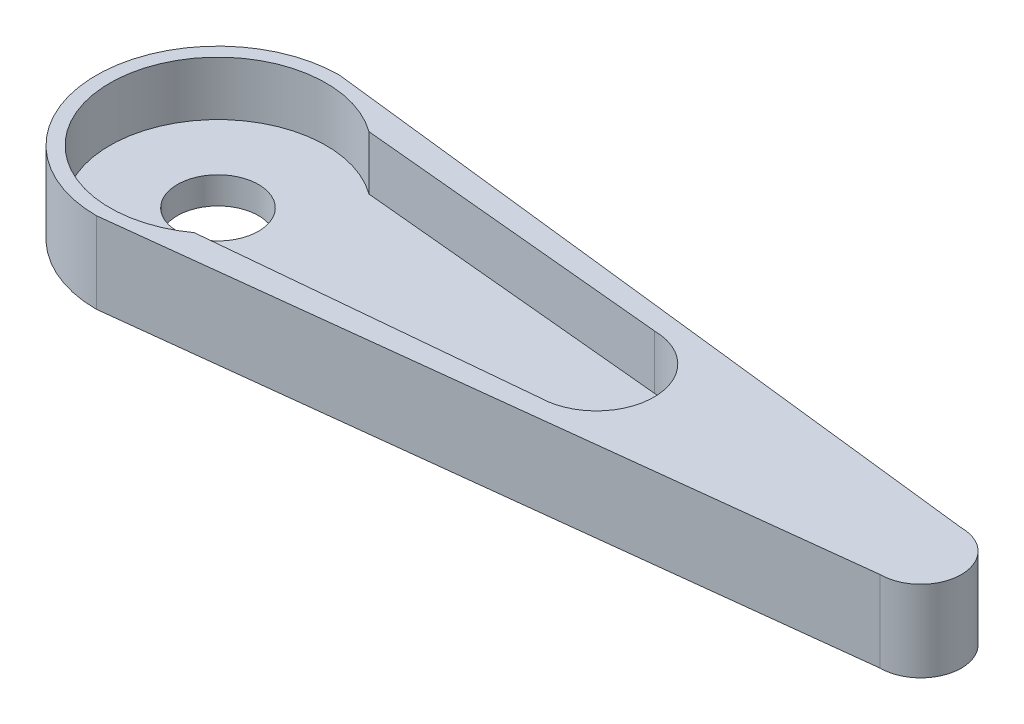
ISO-10303-21;
HEADER;
FILE_DESCRIPTION(('STEP AP214'),'2;1');
FILE_NAME('part.step','',(''),(''),'','','');
FILE_SCHEMA(('AUTOMOTIVE_DESIGN { 1 0 10303 214 1 1 1 1 }'));
ENDSEC;
DATA;
#1=APPLICATION_CONTEXT('core data for automotive mechanical design processes');
#2=APPLICATION_PROTOCOL_DEFINITION('international standard','automotive_design',2000,#1);
#3=PRODUCT_CONTEXT('',#1,'mechanical');
#4=PRODUCT('Part','Part','',(#3));
#5=PRODUCT_RELATED_PRODUCT_CATEGORY('part','',(#4));
#6=PRODUCT_DEFINITION_FORMATION('','',#4);
#7=PRODUCT_DEFINITION_CONTEXT('part definition',#1,'design');
#8=PRODUCT_DEFINITION('design','',#6,#7);
#9=PRODUCT_DEFINITION_SHAPE('','',#8);
#10=(LENGTH_UNIT() NAMED_UNIT(*) SI_UNIT(.MILLI.,.METRE.));
#11=(NAMED_UNIT(*) PLANE_ANGLE_UNIT() SI_UNIT($,.RADIAN.));
#12=(NAMED_UNIT(*) SI_UNIT($,.STERADIAN.) SOLID_ANGLE_UNIT());
#13=UNCERTAINTY_MEASURE_WITH_UNIT(LENGTH_MEASURE(1.E-05),#10,'distance_accuracy_value','');
#14=(GEOMETRIC_REPRESENTATION_CONTEXT(3) GLOBAL_UNCERTAINTY_ASSIGNED_CONTEXT((#13)) GLOBAL_UNIT_ASSIGNED_CONTEXT((#10,
#11,#12)) REPRESENTATION_CONTEXT('',''));
#15=CARTESIAN_POINT('',(0.,0.,0.));
#16=DIRECTION('',(0.,0.,1.));
#17=DIRECTION('',(1.,0.,0.));
#18=AXIS2_PLACEMENT_3D('',#15,#16,#17);
#19=CARTESIAN_POINT('',(-26.9871078638368,1.,0.));
#20=DIRECTION('',(0.,-1.,0.));
#21=DIRECTION('',(0.,0.,-1.));
#22=AXIS2_PLACEMENT_3D('',#19,#20,#21);
#23=CYLINDRICAL_SURFACE('',#22,1.5);
#24=CARTESIAN_POINT('',(-26.9871078638368,1.,0.));
#25=DIRECTION('',(0.,1.,0.));
#26=DIRECTION('',(0.,0.,1.));
#27=AXIS2_PLACEMENT_3D('',#24,#25,#26);
#28=CIRCLE('',#27,1.5);
#29=CARTESIAN_POINT('',(-26.9871078638368,1.,1.5));
#30=VERTEX_POINT('',#29);
#31=EDGE_CURVE('E11',#30,#30,#28,.T.);
#32=ORIENTED_EDGE('',*,*,#31,.T.);
#33=EDGE_LOOP('',(#32));
#34=FACE_BOUND('',#33,.T.);
#35=CARTESIAN_POINT('',(-26.9871078638368,0.,0.));
#36=DIRECTION('',(0.,1.,0.));
#37=DIRECTION('',(0.,0.,1.));
#38=AXIS2_PLACEMENT_3D('',#35,#36,#37);
#39=CIRCLE('',#38,1.5);
#40=CARTESIAN_POINT('',(-26.9871078638368,0.,1.5));
#41=VERTEX_POINT('',#40);
#42=EDGE_CURVE('E48',#41,#41,#39,.T.);
#43=ORIENTED_EDGE('',*,*,#42,.F.);
#44=EDGE_LOOP('',(#43));
#45=FACE_BOUND('',#44,.T.);
#46=ADVANCED_FACE('F45',(#34,#45),#23,.F.);
#47=CARTESIAN_POINT('',(0.,1.,0.));
#48=DIRECTION('',(0.,1.,0.));
#49=DIRECTION('',(0.,0.,1.));
#50=AXIS2_PLACEMENT_3D('',#47,#48,#49);
#51=PLANE('',#50);
#52=CARTESIAN_POINT('',(-26.9871078638368,1.,0.));
#53=DIRECTION('',(0.,1.,0.));
#54=DIRECTION('',(0.,0.,1.));
#55=AXIS2_PLACEMENT_3D('',#52,#53,#54);
#56=CIRCLE('',#55,4.);
#57=CARTESIAN_POINT('',(-24.6336953234997,1.,-3.23441639480509));
#58=VERTEX_POINT('',#57);
#59=CARTESIAN_POINT('',(-24.6336953234997,1.,3.23441639480509));
#60=VERTEX_POINT('',#59);
#61=EDGE_CURVE('E193',#58,#60,#56,.T.);
#62=ORIENTED_EDGE('',*,*,#61,.T.);
#63=DIRECTION('',(-0.995556490145002,0.,0.0941662090676083));
#64=VECTOR('',#63,1.);
#65=CARTESIAN_POINT('',(0.0847856095362401,1.,0.896381671094999));
#66=LINE('',#65,#64);
#67=CARTESIAN_POINT('',(-12.9619425776495,1.,2.13042609377146));
#68=VERTEX_POINT('',#67);
#69=EDGE_CURVE('E196',#68,#60,#66,.T.);
#70=ORIENTED_EDGE('',*,*,#69,.F.);
#71=CARTESIAN_POINT('',(-12.9871078638368,1.,0.));
#72=DIRECTION('',(0.,1.,0.));
#73=DIRECTION('',(0.,0.,1.));
#74=AXIS2_PLACEMENT_3D('',#71,#72,#73);
#75=CIRCLE('',#74,2.13057471886137);
#76=CARTESIAN_POINT('',(-12.9619425776495,1.,-2.13042609377146));
#77=VERTEX_POINT('',#76);
#78=EDGE_CURVE('E65',#68,#77,#75,.T.);
#79=ORIENTED_EDGE('',*,*,#78,.T.);
#80=DIRECTION('',(0.995556490145002,0.,0.0941662090676083));
#81=VECTOR('',#80,1.);
#82=CARTESIAN_POINT('',(0.0847856095362401,1.,-0.896381671094999));
#83=LINE('',#82,#81);
#84=EDGE_CURVE('E54',#58,#77,#83,.T.);
#85=ORIENTED_EDGE('',*,*,#84,.F.);
#86=EDGE_LOOP('',(#62,#70,#79,#85));
#87=FACE_BOUND('',#86,.T.);
#88=ORIENTED_EDGE('',*,*,#31,.F.);
#89=EDGE_LOOP('',(#88));
#90=FACE_BOUND('',#89,.T.);
#91=ADVANCED_FACE('F215',(#87,#90),#51,.T.);
#92=CARTESIAN_POINT('',(0.,0.,0.));
#93=DIRECTION('',(0.,1.,0.));
#94=DIRECTION('',(0.,0.,1.));
#95=AXIS2_PLACEMENT_3D('',#92,#93,#94);
#96=PLANE('',#95);
#97=ORIENTED_EDGE('',*,*,#42,.T.);
#98=EDGE_LOOP('',(#97));
#99=FACE_BOUND('',#98,.T.);
#100=DIRECTION('',(0.993408935871131,0.,0.114624107985131));
#101=VECTOR('',#100,1.);
#102=CARTESIAN_POINT('',(0.157833619307253,0.,-1.36789136732952));
#103=LINE('',#102,#101);
#104=CARTESIAN_POINT('',(-26.9871078638368,0.,-4.5));
#105=VERTEX_POINT('',#104);
#106=CARTESIAN_POINT('',(-0.987107863836847,0.,-1.5));
#107=VERTEX_POINT('',#106);
#108=EDGE_CURVE('E114',#105,#107,#103,.T.);
#109=ORIENTED_EDGE('',*,*,#108,.T.);
#110=CARTESIAN_POINT('',(-0.987107863836847,0.,0.));
#111=DIRECTION('',(0.,1.,0.));
#112=DIRECTION('',(0.,0.,1.));
#113=AXIS2_PLACEMENT_3D('',#110,#111,#112);
#114=CIRCLE('',#113,1.5);
#115=CARTESIAN_POINT('',(-0.987107863836847,0.,1.5));
#116=VERTEX_POINT('',#115);
#117=EDGE_CURVE('E137',#116,#107,#114,.T.);
#118=ORIENTED_EDGE('',*,*,#117,.F.);
#119=DIRECTION('',(-0.993408935871131,0.,0.11462410798513));
#120=VECTOR('',#119,1.);
#121=CARTESIAN_POINT('',(0.157833619307253,0.,1.36789136732953));
#122=LINE('',#121,#120);
#123=CARTESIAN_POINT('',(-26.9871078638368,0.,4.5));
#124=VERTEX_POINT('',#123);
#125=EDGE_CURVE('E141',#116,#124,#122,.T.);
#126=ORIENTED_EDGE('',*,*,#125,.T.);
#127=CARTESIAN_POINT('',(-26.9871078638368,0.,0.));
#128=DIRECTION('',(0.,1.,0.));
#129=DIRECTION('',(0.,0.,1.));
#130=AXIS2_PLACEMENT_3D('',#127,#128,#129);
#131=CIRCLE('',#130,4.5);
#132=EDGE_CURVE('E165',#105,#124,#131,.T.);
#133=ORIENTED_EDGE('',*,*,#132,.F.);
#134=EDGE_LOOP('',(#109,#118,#126,#133));
#135=FACE_BOUND('',#134,.T.);
#136=ADVANCED_FACE('F236',(#99,#135),#96,.F.);
#137=CARTESIAN_POINT('',(-26.9871078638368,3.,0.));
#138=DIRECTION('',(0.,-1.,0.));
#139=DIRECTION('',(0.,0.,-1.));
#140=AXIS2_PLACEMENT_3D('',#137,#138,#139);
#141=CYLINDRICAL_SURFACE('',#140,4.);
#142=DIRECTION('',(0.,-1.,0.));
#143=VECTOR('',#142,1.);
#144=CARTESIAN_POINT('',(-24.6336953234997,3.,3.23441639480509));
#145=LINE('',#144,#143);
#146=CARTESIAN_POINT('',(-24.6336953234997,3.,3.23441639480509));
#147=VERTEX_POINT('',#146);
#148=EDGE_CURVE('E119',#147,#60,#145,.T.);
#149=ORIENTED_EDGE('',*,*,#148,.T.);
#150=ORIENTED_EDGE('',*,*,#61,.F.);
#151=DIRECTION('',(0.,-1.,0.));
#152=VECTOR('',#151,1.);
#153=CARTESIAN_POINT('',(-24.6336953234997,3.,-3.23441639480509));
#154=LINE('',#153,#152);
#155=CARTESIAN_POINT('',(-24.6336953234997,3.,-3.23441639480509));
#156=VERTEX_POINT('',#155);
#157=EDGE_CURVE('E182',#156,#58,#154,.T.);
#158=ORIENTED_EDGE('',*,*,#157,.F.);
#159=CARTESIAN_POINT('',(-26.9871078638368,3.,0.));
#160=DIRECTION('',(0.,1.,0.));
#161=DIRECTION('',(0.,0.,1.));
#162=AXIS2_PLACEMENT_3D('',#159,#160,#161);
#163=CIRCLE('',#162,4.);
#164=EDGE_CURVE('E148',#156,#147,#163,.T.);
#165=ORIENTED_EDGE('',*,*,#164,.T.);
#166=EDGE_LOOP('',(#149,#150,#158,#165));
#167=FACE_BOUND('',#166,.T.);
#168=ADVANCED_FACE('F214',(#167),#141,.F.);
#169=CARTESIAN_POINT('',(0.0847856095362401,3.,-0.896381671094999));
#170=DIRECTION('',(0.0941662090676083,0.,-0.995556490145002));
#171=DIRECTION('',(-0.995556490145002,0.,-0.0941662090676083));
#172=AXIS2_PLACEMENT_3D('',#169,#170,#171);
#173=PLANE('',#172);
#174=ORIENTED_EDGE('',*,*,#84,.T.);
#175=DIRECTION('',(0.,-1.,0.));
#176=VECTOR('',#175,1.);
#177=CARTESIAN_POINT('',(-12.9619425776495,3.,-2.13042609377146));
#178=LINE('',#177,#176);
#179=CARTESIAN_POINT('',(-12.9619425776495,3.,-2.13042609377146));
#180=VERTEX_POINT('',#179);
#181=EDGE_CURVE('E178',#180,#77,#178,.T.);
#182=ORIENTED_EDGE('',*,*,#181,.F.);
#183=DIRECTION('',(0.995556490145002,0.,0.0941662090676083));
#184=VECTOR('',#183,1.);
#185=CARTESIAN_POINT('',(0.0847856095362401,3.,-0.896381671094999));
#186=LINE('',#185,#184);
#187=EDGE_CURVE('E152',#156,#180,#186,.T.);
#188=ORIENTED_EDGE('',*,*,#187,.F.);
#189=ORIENTED_EDGE('',*,*,#157,.T.);
#190=EDGE_LOOP('',(#174,#182,#188,#189));
#191=FACE_BOUND('',#190,.T.);
#192=ADVANCED_FACE('F205',(#191),#173,.F.);
#193=CARTESIAN_POINT('',(-12.9871078638368,3.,0.));
#194=DIRECTION('',(0.,-1.,0.));
#195=DIRECTION('',(0.,0.,-1.));
#196=AXIS2_PLACEMENT_3D('',#193,#194,#195);
#197=CYLINDRICAL_SURFACE('',#196,2.13057471886137);
#198=ORIENTED_EDGE('',*,*,#181,.T.);
#199=ORIENTED_EDGE('',*,*,#78,.F.);
#200=DIRECTION('',(0.,-1.,0.));
#201=VECTOR('',#200,1.);
#202=CARTESIAN_POINT('',(-12.9619425776495,3.,2.13042609377146));
#203=LINE('',#202,#201);
#204=CARTESIAN_POINT('',(-12.9619425776495,3.,2.13042609377146));
#205=VERTEX_POINT('',#204);
#206=EDGE_CURVE('E174',#205,#68,#203,.T.);
#207=ORIENTED_EDGE('',*,*,#206,.F.);
#208=CARTESIAN_POINT('',(-12.9871078638368,3.,0.));
#209=DIRECTION('',(0.,1.,0.));
#210=DIRECTION('',(0.,0.,1.));
#211=AXIS2_PLACEMENT_3D('',#208,#209,#210);
#212=CIRCLE('',#211,2.13057471886137);
#213=EDGE_CURVE('E155',#205,#180,#212,.T.);
#214=ORIENTED_EDGE('',*,*,#213,.T.);
#215=EDGE_LOOP('',(#198,#199,#207,#214));
#216=FACE_BOUND('',#215,.T.);
#217=ADVANCED_FACE('F208',(#216),#197,.F.);
#218=CARTESIAN_POINT('',(0.157833619307253,3.,-1.36789136732952));
#219=DIRECTION('',(0.114624107985131,0.,-0.993408935871131));
#220=DIRECTION('',(-0.993408935871131,0.,-0.114624107985131));
#221=AXIS2_PLACEMENT_3D('',#218,#219,#220);
#222=PLANE('',#221);
#223=ORIENTED_EDGE('',*,*,#108,.F.);
#224=DIRECTION('',(0.,-1.,0.));
#225=VECTOR('',#224,1.);
#226=CARTESIAN_POINT('',(-26.9871078638368,3.,-4.5));
#227=LINE('',#226,#225);
#228=CARTESIAN_POINT('',(-26.9871078638368,3.,-4.5));
#229=VERTEX_POINT('',#228);
#230=EDGE_CURVE('E108',#229,#105,#227,.T.);
#231=ORIENTED_EDGE('',*,*,#230,.F.);
#232=DIRECTION('',(0.993408935871131,0.,0.114624107985131));
#233=VECTOR('',#232,1.);
#234=CARTESIAN_POINT('',(0.157833619307253,3.,-1.36789136732952));
#235=LINE('',#234,#233);
#236=CARTESIAN_POINT('',(-0.987107863836847,3.,-1.5));
#237=VERTEX_POINT('',#236);
#238=EDGE_CURVE('E112',#229,#237,#235,.T.);
#239=ORIENTED_EDGE('',*,*,#238,.T.);
#240=DIRECTION('',(0.,-1.,0.));
#241=VECTOR('',#240,1.);
#242=CARTESIAN_POINT('',(-0.987107863836847,3.,-1.5));
#243=LINE('',#242,#241);
#244=EDGE_CURVE('E162',#237,#107,#243,.T.);
#245=ORIENTED_EDGE('',*,*,#244,.T.);
#246=EDGE_LOOP('',(#223,#231,#239,#245));
#247=FACE_BOUND('',#246,.T.);
#248=ADVANCED_FACE('F110',(#247),#222,.T.);
#249=CARTESIAN_POINT('',(-26.9871078638368,3.,0.));
#250=DIRECTION('',(0.,-1.,0.));
#251=DIRECTION('',(0.,0.,-1.));
#252=AXIS2_PLACEMENT_3D('',#249,#250,#251);
#253=CYLINDRICAL_SURFACE('',#252,4.5);
#254=ORIENTED_EDGE('',*,*,#132,.T.);
#255=DIRECTION('',(0.,-1.,0.));
#256=VECTOR('',#255,1.);
#257=CARTESIAN_POINT('',(-26.9871078638368,3.,4.5));
#258=LINE('',#257,#256);
#259=CARTESIAN_POINT('',(-26.9871078638368,3.,4.5));
#260=VERTEX_POINT('',#259);
#261=EDGE_CURVE('E120',#260,#124,#258,.T.);
#262=ORIENTED_EDGE('',*,*,#261,.F.);
#263=CARTESIAN_POINT('',(-26.9871078638368,3.,0.));
#264=DIRECTION('',(0.,1.,0.));
#265=DIRECTION('',(0.,0.,1.));
#266=AXIS2_PLACEMENT_3D('',#263,#264,#265);
#267=CIRCLE('',#266,4.5);
#268=EDGE_CURVE('E123',#229,#260,#267,.T.);
#269=ORIENTED_EDGE('',*,*,#268,.F.);
#270=ORIENTED_EDGE('',*,*,#230,.T.);
#271=EDGE_LOOP('',(#254,#262,#269,#270));
#272=FACE_BOUND('',#271,.T.);
#273=ADVANCED_FACE('F124',(#272),#253,.T.);
#274=CARTESIAN_POINT('',(0.157833619307253,3.,1.36789136732953));
#275=DIRECTION('',(0.11462410798513,0.,0.993408935871131));
#276=DIRECTION('',(0.993408935871131,0.,-0.11462410798513));
#277=AXIS2_PLACEMENT_3D('',#274,#275,#276);
#278=PLANE('',#277);
#279=ORIENTED_EDGE('',*,*,#125,.F.);
#280=DIRECTION('',(0.,-1.,0.));
#281=VECTOR('',#280,1.);
#282=CARTESIAN_POINT('',(-0.987107863836847,3.,1.5));
#283=LINE('',#282,#281);
#284=CARTESIAN_POINT('',(-0.987107863836847,3.,1.5));
#285=VERTEX_POINT('',#284);
#286=EDGE_CURVE('E188',#285,#116,#283,.T.);
#287=ORIENTED_EDGE('',*,*,#286,.F.);
#288=DIRECTION('',(-0.993408935871131,0.,0.11462410798513));
#289=VECTOR('',#288,1.);
#290=CARTESIAN_POINT('',(0.157833619307253,3.,1.36789136732953));
#291=LINE('',#290,#289);
#292=EDGE_CURVE('E129',#285,#260,#291,.T.);
#293=ORIENTED_EDGE('',*,*,#292,.T.);
#294=ORIENTED_EDGE('',*,*,#261,.T.);
#295=EDGE_LOOP('',(#279,#287,#293,#294));
#296=FACE_BOUND('',#295,.T.);
#297=ADVANCED_FACE('F227',(#296),#278,.T.);
#298=CARTESIAN_POINT('',(-0.987107863836847,3.,0.));
#299=DIRECTION('',(0.,-1.,0.));
#300=DIRECTION('',(0.,0.,-1.));
#301=AXIS2_PLACEMENT_3D('',#298,#299,#300);
#302=CYLINDRICAL_SURFACE('',#301,1.5);
#303=ORIENTED_EDGE('',*,*,#117,.T.);
#304=ORIENTED_EDGE('',*,*,#244,.F.);
#305=CARTESIAN_POINT('',(-0.987107863836847,3.,0.));
#306=DIRECTION('',(0.,1.,0.));
#307=DIRECTION('',(0.,0.,1.));
#308=AXIS2_PLACEMENT_3D('',#305,#306,#307);
#309=CIRCLE('',#308,1.5);
#310=EDGE_CURVE('E134',#285,#237,#309,.T.);
#311=ORIENTED_EDGE('',*,*,#310,.F.);
#312=ORIENTED_EDGE('',*,*,#286,.T.);
#313=EDGE_LOOP('',(#303,#304,#311,#312));
#314=FACE_BOUND('',#313,.T.);
#315=ADVANCED_FACE('F220',(#314),#302,.T.);
#316=CARTESIAN_POINT('',(0.0847856095362401,3.,0.896381671094999));
#317=DIRECTION('',(0.0941662090676083,0.,0.995556490145002));
#318=DIRECTION('',(0.995556490145002,0.,-0.0941662090676083));
#319=AXIS2_PLACEMENT_3D('',#316,#317,#318);
#320=PLANE('',#319);
#321=ORIENTED_EDGE('',*,*,#69,.T.);
#322=ORIENTED_EDGE('',*,*,#148,.F.);
#323=DIRECTION('',(-0.995556490145002,0.,0.0941662090676083));
#324=VECTOR('',#323,1.);
#325=CARTESIAN_POINT('',(0.0847856095362401,3.,0.896381671094999));
#326=LINE('',#325,#324);
#327=EDGE_CURVE('E159',#205,#147,#326,.T.);
#328=ORIENTED_EDGE('',*,*,#327,.F.);
#329=ORIENTED_EDGE('',*,*,#206,.T.);
#330=EDGE_LOOP('',(#321,#322,#328,#329));
#331=FACE_BOUND('',#330,.T.);
#332=ADVANCED_FACE('F218',(#331),#320,.F.);
#333=CARTESIAN_POINT('',(0.,3.,0.));
#334=DIRECTION('',(0.,1.,0.));
#335=DIRECTION('',(0.,0.,1.));
#336=AXIS2_PLACEMENT_3D('',#333,#334,#335);
#337=PLANE('',#336);
#338=ORIENTED_EDGE('',*,*,#238,.F.);
#339=ORIENTED_EDGE('',*,*,#268,.T.);
#340=ORIENTED_EDGE('',*,*,#292,.F.);
#341=ORIENTED_EDGE('',*,*,#310,.T.);
#342=EDGE_LOOP('',(#338,#339,#340,#341));
#343=FACE_BOUND('',#342,.T.);
#344=ORIENTED_EDGE('',*,*,#164,.F.);
#345=ORIENTED_EDGE('',*,*,#187,.T.);
#346=ORIENTED_EDGE('',*,*,#213,.F.);
#347=ORIENTED_EDGE('',*,*,#327,.T.);
#348=EDGE_LOOP('',(#344,#345,#346,#347));
#349=FACE_BOUND('',#348,.T.);
#350=ADVANCED_FACE('F131',(#343,#349),#337,.T.);
#351=CLOSED_SHELL('',(#46,#91,#136,#168,#192,#217,#248,#273,#297,#315,#332,#350));
#352=MANIFOLD_SOLID_BREP('B2',#351);
#353=ADVANCED_BREP_SHAPE_REPRESENTATION('',(#18,#352),#14);
#354=SHAPE_DEFINITION_REPRESENTATION(#9,#353);
ENDSEC;
END-ISO-10303-21;
